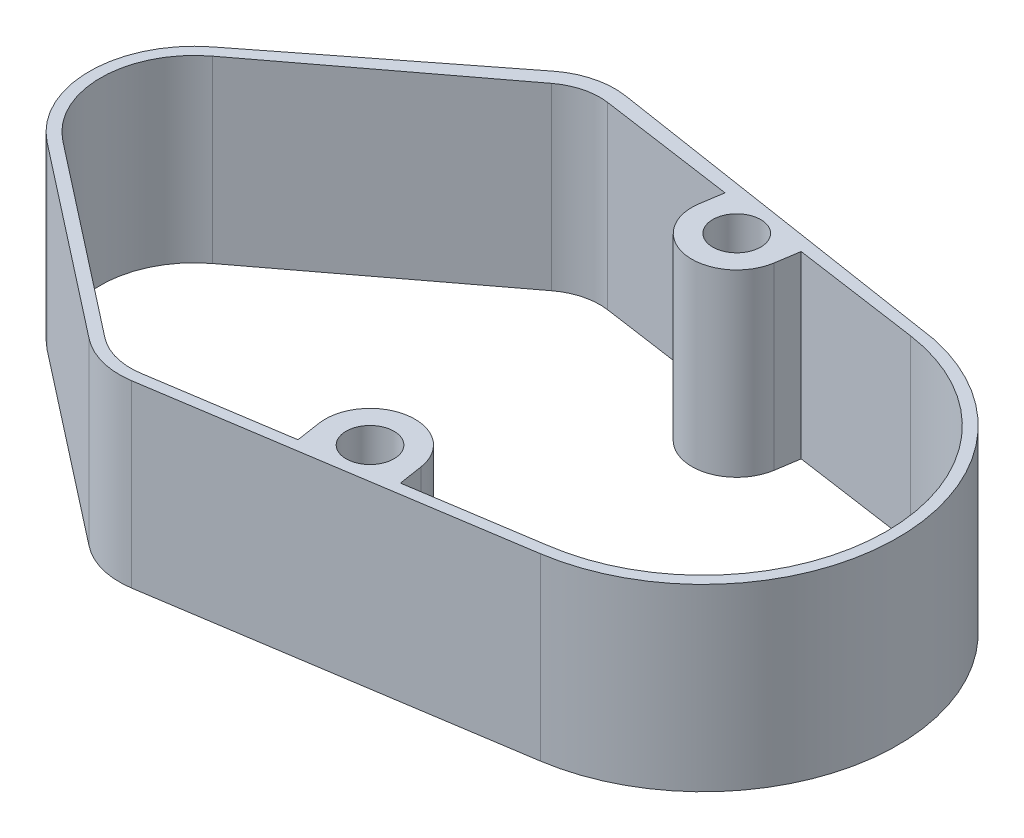
ISO-10303-21;
HEADER;
FILE_DESCRIPTION(('STEP AP214'),'2;1');
FILE_NAME('part.step','',(''),(''),'','','');
FILE_SCHEMA(('AUTOMOTIVE_DESIGN { 1 0 10303 214 1 1 1 1 }'));
ENDSEC;
DATA;
#1=APPLICATION_CONTEXT('core data for automotive mechanical design processes');
#2=APPLICATION_PROTOCOL_DEFINITION('international standard','automotive_design',2000,#1);
#3=PRODUCT_CONTEXT('',#1,'mechanical');
#4=PRODUCT('Part','Part','',(#3));
#5=PRODUCT_RELATED_PRODUCT_CATEGORY('part','',(#4));
#6=PRODUCT_DEFINITION_FORMATION('','',#4);
#7=PRODUCT_DEFINITION_CONTEXT('part definition',#1,'design');
#8=PRODUCT_DEFINITION('design','',#6,#7);
#9=PRODUCT_DEFINITION_SHAPE('','',#8);
#10=(LENGTH_UNIT() NAMED_UNIT(*) SI_UNIT(.MILLI.,.METRE.));
#11=(NAMED_UNIT(*) PLANE_ANGLE_UNIT() SI_UNIT($,.RADIAN.));
#12=(NAMED_UNIT(*) SI_UNIT($,.STERADIAN.) SOLID_ANGLE_UNIT());
#13=UNCERTAINTY_MEASURE_WITH_UNIT(LENGTH_MEASURE(1.E-05),#10,'distance_accuracy_value','');
#14=(GEOMETRIC_REPRESENTATION_CONTEXT(3) GLOBAL_UNCERTAINTY_ASSIGNED_CONTEXT((#13)) GLOBAL_UNIT_ASSIGNED_CONTEXT((#10,
#11,#12)) REPRESENTATION_CONTEXT('',''));
#15=CARTESIAN_POINT('',(0.,0.,0.));
#16=DIRECTION('',(0.,0.,1.));
#17=DIRECTION('',(1.,0.,0.));
#18=AXIS2_PLACEMENT_3D('',#15,#16,#17);
#19=CARTESIAN_POINT('',(2.76732765579161,2.,17.9645399683825));
#20=DIRECTION('',(0.152248095776488,0.,0.988342307772177));
#21=DIRECTION('',(0.988342307772177,0.,-0.152248095776488));
#22=AXIS2_PLACEMENT_3D('',#19,#20,#21);
#23=PLANE('',#22);
#24=DIRECTION('',(0.,-1.,0.));
#25=VECTOR('',#24,1.);
#26=CARTESIAN_POINT('',(35.9792252450943,2.,12.8484500010383));
#27=LINE('',#26,#25);
#28=CARTESIAN_POINT('',(35.9792252450943,14.,12.8484500010383));
#29=VERTEX_POINT('',#28);
#30=CARTESIAN_POINT('',(35.9792252450943,2.,12.8484500010383));
#31=VERTEX_POINT('',#30);
#32=EDGE_CURVE('E43',#29,#31,#27,.T.);
#33=ORIENTED_EDGE('',*,*,#32,.F.);
#34=DIRECTION('',(0.988342307772177,0.,-0.152248095776488));
#35=VECTOR('',#34,1.);
#36=CARTESIAN_POINT('',(35.9792252450943,14.,12.8484500010383));
#37=LINE('',#36,#35);
#38=CARTESIAN_POINT('',(12.3135895146823,14.,16.493996637018));
#39=VERTEX_POINT('',#38);
#40=EDGE_CURVE('E312',#39,#29,#37,.T.);
#41=ORIENTED_EDGE('',*,*,#40,.F.);
#42=DIRECTION('',(0.,-1.,0.));
#43=VECTOR('',#42,1.);
#44=CARTESIAN_POINT('',(12.3135895146823,2.,16.493996637018));
#45=LINE('',#44,#43);
#46=CARTESIAN_POINT('',(12.3135895146823,2.,16.493996637018));
#47=VERTEX_POINT('',#46);
#48=EDGE_CURVE('E385',#39,#47,#45,.T.);
#49=ORIENTED_EDGE('',*,*,#48,.T.);
#50=DIRECTION('',(-0.988342307772177,0.,0.152248095776488));
#51=VECTOR('',#50,1.);
#52=CARTESIAN_POINT('',(2.76732765579161,2.,17.9645399683825));
#53=LINE('',#52,#51);
#54=EDGE_CURVE('E324',#31,#47,#53,.T.);
#55=ORIENTED_EDGE('',*,*,#54,.F.);
#56=EDGE_LOOP('',(#33,#41,#49,#55));
#57=FACE_BOUND('',#56,.T.);
#58=ADVANCED_FACE('F40',(#57),#23,.T.);
#59=CARTESIAN_POINT('',(34.,2.,0.));
#60=DIRECTION('',(0.,-1.,0.));
#61=DIRECTION('',(0.,0.,-1.));
#62=AXIS2_PLACEMENT_3D('',#59,#60,#61);
#63=CYLINDRICAL_SURFACE('',#62,13.);
#64=ORIENTED_EDGE('',*,*,#32,.T.);
#65=CARTESIAN_POINT('',(34.,2.,0.));
#66=DIRECTION('',(0.,1.,0.));
#67=DIRECTION('',(0.,0.,1.));
#68=AXIS2_PLACEMENT_3D('',#65,#66,#67);
#69=CIRCLE('',#68,13.);
#70=CARTESIAN_POINT('',(36.8136480405111,2.,-12.6918629327663));
#71=VERTEX_POINT('',#70);
#72=EDGE_CURVE('E321',#31,#71,#69,.T.);
#73=ORIENTED_EDGE('',*,*,#72,.T.);
#74=DIRECTION('',(0.,-1.,0.));
#75=VECTOR('',#74,1.);
#76=CARTESIAN_POINT('',(36.8136480405111,2.,-12.6918629327663));
#77=LINE('',#76,#75);
#78=CARTESIAN_POINT('',(36.8136480405111,14.,-12.6918629327663));
#79=VERTEX_POINT('',#78);
#80=EDGE_CURVE('E400',#79,#71,#77,.T.);
#81=ORIENTED_EDGE('',*,*,#80,.F.);
#82=CARTESIAN_POINT('',(34.,14.,0.));
#83=DIRECTION('',(0.,1.,0.));
#84=DIRECTION('',(0.,0.,-1.));
#85=AXIS2_PLACEMENT_3D('',#82,#83,#84);
#86=CIRCLE('',#85,13.);
#87=EDGE_CURVE('E314',#29,#79,#86,.T.);
#88=ORIENTED_EDGE('',*,*,#87,.F.);
#89=EDGE_LOOP('',(#64,#73,#81,#88));
#90=FACE_BOUND('',#89,.T.);
#91=ADVANCED_FACE('F408',(#90),#63,.T.);
#92=CARTESIAN_POINT('',(2.78895107485444,2.,-17.9719394377376));
#93=DIRECTION('',(-0.153348167519012,0.,0.988172221588201));
#94=DIRECTION('',(0.988172221588201,0.,0.153348167519012));
#95=AXIS2_PLACEMENT_3D('',#92,#93,#94);
#96=PLANE('',#95);
#97=DIRECTION('',(-0.988172221588201,0.,-0.153348167519012));
#98=VECTOR('',#97,1.);
#99=CARTESIAN_POINT('',(2.78895107485444,2.,-17.9719394377376));
#100=LINE('',#99,#98);
#101=CARTESIAN_POINT('',(12.3190673039404,2.,-16.4930212612838));
#102=VERTEX_POINT('',#101);
#103=EDGE_CURVE('E319',#71,#102,#100,.T.);
#104=ORIENTED_EDGE('',*,*,#103,.T.);
#105=DIRECTION('',(0.,-1.,0.));
#106=VECTOR('',#105,1.);
#107=CARTESIAN_POINT('',(12.3190673039404,2.,-16.4930212612838));
#108=LINE('',#107,#106);
#109=CARTESIAN_POINT('',(12.3190673039404,14.,-16.4930212612838));
#110=VERTEX_POINT('',#109);
#111=EDGE_CURVE('E398',#110,#102,#108,.T.);
#112=ORIENTED_EDGE('',*,*,#111,.F.);
#113=DIRECTION('',(-0.988172221588201,0.,-0.153348167519012));
#114=VECTOR('',#113,1.);
#115=CARTESIAN_POINT('',(12.3190673039404,14.,-16.4930212612838));
#116=LINE('',#115,#114);
#117=EDGE_CURVE('E317',#79,#110,#116,.T.);
#118=ORIENTED_EDGE('',*,*,#117,.F.);
#119=ORIENTED_EDGE('',*,*,#80,.T.);
#120=EDGE_LOOP('',(#104,#112,#118,#119));
#121=FACE_BOUND('',#120,.T.);
#122=ADVANCED_FACE('F434',(#121),#96,.F.);
#123=CARTESIAN_POINT('',(11.5523264663453,2.,-11.5521601533428));
#124=DIRECTION('',(0.,-1.,0.));
#125=DIRECTION('',(0.,0.,-1.));
#126=AXIS2_PLACEMENT_3D('',#123,#124,#125);
#127=CYLINDRICAL_SURFACE('',#126,5.);
#128=ORIENTED_EDGE('',*,*,#111,.T.);
#129=CARTESIAN_POINT('',(11.5523264663453,2.,-11.5521601533428));
#130=DIRECTION('',(0.,1.,0.));
#131=DIRECTION('',(0.,0.,1.));
#132=AXIS2_PLACEMENT_3D('',#129,#130,#131);
#133=CIRCLE('',#132,5.);
#134=CARTESIAN_POINT('',(8.47622977455886,2.,-15.4939400993545));
#135=VERTEX_POINT('',#134);
#136=EDGE_CURVE('E11',#102,#135,#133,.T.);
#137=ORIENTED_EDGE('',*,*,#136,.T.);
#138=DIRECTION('',(0.,-1.,0.));
#139=VECTOR('',#138,1.);
#140=CARTESIAN_POINT('',(8.47622977455886,12.,-15.4939400993545));
#141=LINE('',#140,#139);
#142=CARTESIAN_POINT('',(8.47622977455886,14.,-15.4939400993545));
#143=VERTEX_POINT('',#142);
#144=EDGE_CURVE('E359',#143,#135,#141,.T.);
#145=ORIENTED_EDGE('',*,*,#144,.F.);
#146=CARTESIAN_POINT('',(11.5523264663454,14.,-11.5521601533428));
#147=DIRECTION('',(0.,1.,0.));
#148=DIRECTION('',(0.,0.,-1.));
#149=AXIS2_PLACEMENT_3D('',#146,#147,#148);
#150=CIRCLE('',#149,5.00000000000003);
#151=EDGE_CURVE('E297',#110,#143,#150,.T.);
#152=ORIENTED_EDGE('',*,*,#151,.F.);
#153=EDGE_LOOP('',(#128,#137,#145,#152));
#154=FACE_BOUND('',#153,.T.);
#155=ADVANCED_FACE('F430',(#154),#127,.T.);
#156=CARTESIAN_POINT('',(11.5523490357999,2.,11.5522850981571));
#157=DIRECTION('',(0.,-1.,0.));
#158=DIRECTION('',(0.,0.,-1.));
#159=AXIS2_PLACEMENT_3D('',#156,#157,#158);
#160=CYLINDRICAL_SURFACE('',#159,5.00000000000001);
#161=CARTESIAN_POINT('',(11.5523490357999,2.,11.5522850981571));
#162=DIRECTION('',(0.,1.,0.));
#163=DIRECTION('',(0.,0.,1.));
#164=AXIS2_PLACEMENT_3D('',#161,#162,#163);
#165=CIRCLE('',#164,5.00000000000001);
#166=CARTESIAN_POINT('',(8.45337216873125,2.,15.4761024202777));
#167=VERTEX_POINT('',#166);
#168=EDGE_CURVE('E334',#167,#47,#165,.T.);
#169=ORIENTED_EDGE('',*,*,#168,.T.);
#170=ORIENTED_EDGE('',*,*,#48,.F.);
#171=CARTESIAN_POINT('',(11.5523490357999,14.,11.5522850981569));
#172=DIRECTION('',(0.,1.,0.));
#173=DIRECTION('',(0.,0.,1.));
#174=AXIS2_PLACEMENT_3D('',#171,#172,#173);
#175=CIRCLE('',#174,5.00000000000016);
#176=CARTESIAN_POINT('',(8.45337216873125,14.,15.4761024202777));
#177=VERTEX_POINT('',#176);
#178=EDGE_CURVE('E309',#177,#39,#175,.T.);
#179=ORIENTED_EDGE('',*,*,#178,.F.);
#180=DIRECTION('',(0.,-1.,0.));
#181=VECTOR('',#180,1.);
#182=CARTESIAN_POINT('',(8.45337216873125,12.,15.4761024202777));
#183=LINE('',#182,#181);
#184=EDGE_CURVE('E388',#177,#167,#183,.T.);
#185=ORIENTED_EDGE('',*,*,#184,.T.);
#186=EDGE_LOOP('',(#169,#170,#179,#185));
#187=FACE_BOUND('',#186,.T.);
#188=ADVANCED_FACE('F415',(#187),#160,.T.);
#189=CARTESIAN_POINT('',(2.65295718564578,12.,17.2225081490792));
#190=DIRECTION('',(-0.152244452065252,0.,-0.988342869056762));
#191=DIRECTION('',(-0.988342869056762,0.,0.152244452065252));
#192=AXIS2_PLACEMENT_3D('',#189,#190,#191);
#193=PLANE('',#192);
#194=DIRECTION('',(0.,1.,0.));
#195=VECTOR('',#194,1.);
#196=CARTESIAN_POINT('',(21.2883996349892,12.,14.3519023972499));
#197=LINE('',#196,#195);
#198=CARTESIAN_POINT('',(21.2883996349892,2.,14.3519023972499));
#199=VERTEX_POINT('',#198);
#200=CARTESIAN_POINT('',(21.2883996349892,14.,14.3519023972499));
#201=VERTEX_POINT('',#200);
#202=EDGE_CURVE('E63',#199,#201,#197,.T.);
#203=ORIENTED_EDGE('',*,*,#202,.F.);
#204=DIRECTION('',(0.988342869056762,0.,-0.152244452065252));
#205=VECTOR('',#204,1.);
#206=CARTESIAN_POINT('',(2.65295718564578,2.,17.2225081490792));
#207=LINE('',#206,#205);
#208=CARTESIAN_POINT('',(12.2786286195108,2.,15.7397685866361));
#209=VERTEX_POINT('',#208);
#210=EDGE_CURVE('E336',#209,#199,#207,.T.);
#211=ORIENTED_EDGE('',*,*,#210,.F.);
#212=DIRECTION('',(0.,-1.,0.));
#213=VECTOR('',#212,1.);
#214=CARTESIAN_POINT('',(12.2786286195108,12.,15.7397685866361));
#215=LINE('',#214,#213);
#216=CARTESIAN_POINT('',(12.2786286195108,14.,15.7397685866361));
#217=VERTEX_POINT('',#216);
#218=EDGE_CURVE('E382',#217,#209,#215,.T.);
#219=ORIENTED_EDGE('',*,*,#218,.F.);
#220=DIRECTION('',(0.988342869056762,0.,-0.152244452065252));
#221=VECTOR('',#220,1.);
#222=CARTESIAN_POINT('',(12.2786286195108,14.,15.7397685866361));
#223=LINE('',#222,#221);
#224=EDGE_CURVE('E288',#217,#201,#223,.T.);
#225=ORIENTED_EDGE('',*,*,#224,.T.);
#226=EDGE_LOOP('',(#203,#211,#219,#225));
#227=FACE_BOUND('',#226,.T.);
#228=ADVANCED_FACE('F468',(#227),#193,.T.);
#229=CARTESIAN_POINT('',(11.5523490357999,12.,11.5522850981571));
#230=DIRECTION('',(0.,-1.,0.));
#231=DIRECTION('',(0.,0.,-1.));
#232=AXIS2_PLACEMENT_3D('',#229,#230,#231);
#233=CYLINDRICAL_SURFACE('',#232,4.25);
#234=CARTESIAN_POINT('',(11.5523490357999,2.,11.5522850981571));
#235=DIRECTION('',(0.,1.,0.));
#236=DIRECTION('',(0.,0.,1.));
#237=AXIS2_PLACEMENT_3D('',#234,#235,#236);
#238=CIRCLE('',#237,4.25);
#239=CARTESIAN_POINT('',(8.93764936313277,2.,14.9027844074772));
#240=VERTEX_POINT('',#239);
#241=EDGE_CURVE('E339',#240,#209,#238,.T.);
#242=ORIENTED_EDGE('',*,*,#241,.F.);
#243=DIRECTION('',(0.,-1.,0.));
#244=VECTOR('',#243,1.);
#245=CARTESIAN_POINT('',(8.93764936313277,12.,14.9027844074772));
#246=LINE('',#245,#244);
#247=CARTESIAN_POINT('',(8.93764936313277,14.,14.9027844074772));
#248=VERTEX_POINT('',#247);
#249=EDGE_CURVE('E379',#248,#240,#246,.T.);
#250=ORIENTED_EDGE('',*,*,#249,.F.);
#251=CARTESIAN_POINT('',(11.5523490357999,14.,11.5522850981571));
#252=DIRECTION('',(0.,1.,0.));
#253=DIRECTION('',(0.,0.,-1.));
#254=AXIS2_PLACEMENT_3D('',#251,#252,#253);
#255=CIRCLE('',#254,4.25000000000003);
#256=EDGE_CURVE('E285',#248,#217,#255,.T.);
#257=ORIENTED_EDGE('',*,*,#256,.T.);
#258=ORIENTED_EDGE('',*,*,#218,.T.);
#259=EDGE_LOOP('',(#242,#250,#257,#258));
#260=FACE_BOUND('',#259,.T.);
#261=ADVANCED_FACE('F476',(#260),#233,.F.);
#262=CARTESIAN_POINT('',(-3.84514657745198,12.,4.92720486664771));
#263=DIRECTION('',(-0.615223452392257,0.,0.788352778663558));
#264=DIRECTION('',(0.788352778663558,0.,0.615223452392257));
#265=AXIS2_PLACEMENT_3D('',#262,#263,#264);
#266=PLANE('',#265);
#267=DIRECTION('',(-0.788352778663558,0.,-0.615223452392257));
#268=VECTOR('',#267,1.);
#269=CARTESIAN_POINT('',(-3.84514657745198,2.,4.92720486664771));
#270=LINE('',#269,#268);
#271=CARTESIAN_POINT('',(-3.84514657745198,2.,4.92720486664771));
#272=VERTEX_POINT('',#271);
#273=EDGE_CURVE('E341',#240,#272,#270,.T.);
#274=ORIENTED_EDGE('',*,*,#273,.T.);
#275=DIRECTION('',(0.,-1.,0.));
#276=VECTOR('',#275,1.);
#277=CARTESIAN_POINT('',(-3.84514657745198,12.,4.92720486664771));
#278=LINE('',#277,#276);
#279=CARTESIAN_POINT('',(-3.84514657745198,14.,4.92720486664771));
#280=VERTEX_POINT('',#279);
#281=EDGE_CURVE('E376',#280,#272,#278,.T.);
#282=ORIENTED_EDGE('',*,*,#281,.F.);
#283=DIRECTION('',(0.788352778663558,0.,0.615223452392257));
#284=VECTOR('',#283,1.);
#285=CARTESIAN_POINT('',(-3.84514657745198,14.,4.92720486664771));
#286=LINE('',#285,#284);
#287=EDGE_CURVE('E282',#280,#248,#286,.T.);
#288=ORIENTED_EDGE('',*,*,#287,.T.);
#289=ORIENTED_EDGE('',*,*,#249,.T.);
#290=EDGE_LOOP('',(#274,#282,#288,#289));
#291=FACE_BOUND('',#290,.T.);
#292=ADVANCED_FACE('F481',(#291),#266,.F.);
#293=CARTESIAN_POINT('',(0.,12.,0.));
#294=DIRECTION('',(0.,-1.,0.));
#295=DIRECTION('',(0.,0.,-1.));
#296=AXIS2_PLACEMENT_3D('',#293,#294,#295);
#297=CYLINDRICAL_SURFACE('',#296,6.2500000000006);
#298=CARTESIAN_POINT('',(0.,2.,0.));
#299=DIRECTION('',(0.,1.,0.));
#300=DIRECTION('',(0.,0.,1.));
#301=AXIS2_PLACEMENT_3D('',#298,#299,#300);
#302=CIRCLE('',#301,6.2500000000006);
#303=CARTESIAN_POINT('',(-3.76862092271279,2.,-4.98597997798817));
#304=VERTEX_POINT('',#303);
#305=EDGE_CURVE('E344',#304,#272,#302,.T.);
#306=ORIENTED_EDGE('',*,*,#305,.F.);
#307=DIRECTION('',(0.,-1.,0.));
#308=VECTOR('',#307,1.);
#309=CARTESIAN_POINT('',(-3.76862092271279,12.,-4.98597997798817));
#310=LINE('',#309,#308);
#311=CARTESIAN_POINT('',(-3.76862092271279,14.,-4.98597997798817));
#312=VERTEX_POINT('',#311);
#313=EDGE_CURVE('E373',#312,#304,#310,.T.);
#314=ORIENTED_EDGE('',*,*,#313,.F.);
#315=CARTESIAN_POINT('',(0.,14.,0.));
#316=DIRECTION('',(0.,1.,0.));
#317=DIRECTION('',(0.,0.,1.));
#318=AXIS2_PLACEMENT_3D('',#315,#316,#317);
#319=CIRCLE('',#318,6.25000000000062);
#320=EDGE_CURVE('E279',#312,#280,#319,.T.);
#321=ORIENTED_EDGE('',*,*,#320,.T.);
#322=ORIENTED_EDGE('',*,*,#281,.T.);
#323=EDGE_LOOP('',(#306,#314,#321,#322));
#324=FACE_BOUND('',#323,.T.);
#325=ADVANCED_FACE('F492',(#324),#297,.F.);
#326=CARTESIAN_POINT('',(-3.76862092271279,12.,-4.98597997798817));
#327=DIRECTION('',(0.602979347633988,0.,0.797756796478031));
#328=DIRECTION('',(0.797756796478031,0.,-0.602979347633988));
#329=AXIS2_PLACEMENT_3D('',#326,#327,#328);
#330=PLANE('',#329);
#331=DIRECTION('',(-0.797756796478031,0.,0.602979347633988));
#332=VECTOR('',#331,1.);
#333=CARTESIAN_POINT('',(-3.76862092271279,2.,-4.98597997798817));
#334=LINE('',#333,#332);
#335=CARTESIAN_POINT('',(9.14040907580912,2.,-14.7431873392553));
#336=VERTEX_POINT('',#335);
#337=EDGE_CURVE('E346',#336,#304,#334,.T.);
#338=ORIENTED_EDGE('',*,*,#337,.F.);
#339=DIRECTION('',(0.,-1.,0.));
#340=VECTOR('',#339,1.);
#341=CARTESIAN_POINT('',(9.14040907580912,12.,-14.7431873392553));
#342=LINE('',#341,#340);
#343=CARTESIAN_POINT('',(9.14040907580912,14.,-14.7431873392553));
#344=VERTEX_POINT('',#343);
#345=EDGE_CURVE('E370',#344,#336,#342,.T.);
#346=ORIENTED_EDGE('',*,*,#345,.F.);
#347=DIRECTION('',(-0.797756796478031,0.,0.602979347633988));
#348=VECTOR('',#347,1.);
#349=CARTESIAN_POINT('',(9.14040907580912,14.,-14.7431873392553));
#350=LINE('',#349,#348);
#351=EDGE_CURVE('E276',#344,#312,#350,.T.);
#352=ORIENTED_EDGE('',*,*,#351,.T.);
#353=ORIENTED_EDGE('',*,*,#313,.T.);
#354=EDGE_LOOP('',(#338,#346,#352,#353));
#355=FACE_BOUND('',#354,.T.);
#356=ADVANCED_FACE('F503',(#355),#330,.T.);
#357=CARTESIAN_POINT('',(11.5523264663453,12.,-11.5521601533428));
#358=DIRECTION('',(0.,-1.,0.));
#359=DIRECTION('',(0.,0.,-1.));
#360=AXIS2_PLACEMENT_3D('',#357,#358,#359);
#361=CYLINDRICAL_SURFACE('',#360,4.00000000000045);
#362=CARTESIAN_POINT('',(11.5523264663453,2.,-11.5521601533428));
#363=DIRECTION('',(0.,1.,0.));
#364=DIRECTION('',(0.,0.,1.));
#365=AXIS2_PLACEMENT_3D('',#362,#363,#364);
#366=CIRCLE('',#365,4.00000000000045);
#367=CARTESIAN_POINT('',(12.1199163344507,2.,-15.5116855973358));
#368=VERTEX_POINT('',#367);
#369=EDGE_CURVE('E348',#368,#336,#366,.T.);
#370=ORIENTED_EDGE('',*,*,#369,.F.);
#371=DIRECTION('',(0.,-1.,0.));
#372=VECTOR('',#371,1.);
#373=CARTESIAN_POINT('',(12.1199163344507,12.,-15.5116855973358));
#374=LINE('',#373,#372);
#375=CARTESIAN_POINT('',(12.1199163344507,14.,-15.5116855973358));
#376=VERTEX_POINT('',#375);
#377=EDGE_CURVE('E367',#376,#368,#374,.T.);
#378=ORIENTED_EDGE('',*,*,#377,.F.);
#379=CARTESIAN_POINT('',(11.5523264663454,14.,-11.5521601533428));
#380=DIRECTION('',(0.,1.,0.));
#381=DIRECTION('',(0.,0.,-1.));
#382=AXIS2_PLACEMENT_3D('',#379,#380,#381);
#383=CIRCLE('',#382,4.00000000000048);
#384=EDGE_CURVE('E273',#376,#344,#383,.T.);
#385=ORIENTED_EDGE('',*,*,#384,.T.);
#386=ORIENTED_EDGE('',*,*,#345,.T.);
#387=EDGE_LOOP('',(#370,#378,#385,#386));
#388=FACE_BOUND('',#387,.T.);
#389=ADVANCED_FACE('F514',(#388),#361,.F.);
#390=CARTESIAN_POINT('',(2.42283027012117,12.,-16.9017430368225));
#391=DIRECTION('',(0.141897467026329,0.,-0.989881360998131));
#392=DIRECTION('',(-0.989881360998131,0.,-0.141897467026329));
#393=AXIS2_PLACEMENT_3D('',#390,#391,#392);
#394=PLANE('',#393);
#395=DIRECTION('',(0.989881360998131,0.,0.141897467026329));
#396=VECTOR('',#395,1.);
#397=CARTESIAN_POINT('',(2.42283027012117,2.,-16.9017430368225));
#398=LINE('',#397,#396);
#399=CARTESIAN_POINT('',(21.2667779179853,2.,-14.2005017109807));
#400=VERTEX_POINT('',#399);
#401=EDGE_CURVE('E350',#368,#400,#398,.T.);
#402=ORIENTED_EDGE('',*,*,#401,.T.);
#403=DIRECTION('',(0.,1.,0.));
#404=VECTOR('',#403,1.);
#405=CARTESIAN_POINT('',(21.2667779179853,12.,-14.2005017109807));
#406=LINE('',#405,#404);
#407=CARTESIAN_POINT('',(21.2667779179853,14.,-14.2005017109807));
#408=VERTEX_POINT('',#407);
#409=EDGE_CURVE('E269',#400,#408,#406,.T.);
#410=ORIENTED_EDGE('',*,*,#409,.T.);
#411=DIRECTION('',(-0.989881360998131,0.,-0.141897467026329));
#412=VECTOR('',#411,1.);
#413=CARTESIAN_POINT('',(22.1338286093925,14.,-14.0762117690324));
#414=LINE('',#413,#412);
#415=EDGE_CURVE('E271',#408,#376,#414,.T.);
#416=ORIENTED_EDGE('',*,*,#415,.T.);
#417=ORIENTED_EDGE('',*,*,#377,.T.);
#418=EDGE_LOOP('',(#402,#410,#416,#417));
#419=FACE_BOUND('',#418,.T.);
#420=ADVANCED_FACE('F525',(#419),#394,.F.);
#421=CARTESIAN_POINT('',(2.42283027012117,12.,-16.9017430368225));
#422=DIRECTION('',(0.141897467026329,0.,-0.989881360998131));
#423=DIRECTION('',(-0.989881360998131,0.,-0.141897467026329));
#424=AXIS2_PLACEMENT_3D('',#421,#422,#423);
#425=PLANE('',#424);
#426=DIRECTION('',(-0.989881360998131,0.,-0.141897467026329));
#427=VECTOR('',#426,1.);
#428=CARTESIAN_POINT('',(35.7382439710726,14.,-12.1260466722273));
#429=LINE('',#428,#427);
#430=CARTESIAN_POINT('',(35.7382439710726,14.,-12.1260466722273));
#431=VERTEX_POINT('',#430);
#432=CARTESIAN_POINT('',(27.206464160853,14.,-13.3490598453169));
#433=VERTEX_POINT('',#432);
#434=EDGE_CURVE('E295',#431,#433,#429,.T.);
#435=ORIENTED_EDGE('',*,*,#434,.T.);
#436=DIRECTION('',(0.,-1.,0.));
#437=VECTOR('',#436,1.);
#438=CARTESIAN_POINT('',(27.206464160853,12.,-13.3490598453169));
#439=LINE('',#438,#437);
#440=CARTESIAN_POINT('',(27.206464160853,2.,-13.3490598453169));
#441=VERTEX_POINT('',#440);
#442=EDGE_CURVE('E266',#433,#441,#439,.T.);
#443=ORIENTED_EDGE('',*,*,#442,.T.);
#444=DIRECTION('',(0.989881360998131,0.,0.141897467026329));
#445=VECTOR('',#444,1.);
#446=CARTESIAN_POINT('',(2.42283027012117,2.,-16.9017430368225));
#447=LINE('',#446,#445);
#448=CARTESIAN_POINT('',(35.7382439710726,2.,-12.1260466722273));
#449=VERTEX_POINT('',#448);
#450=EDGE_CURVE('E352',#441,#449,#447,.T.);
#451=ORIENTED_EDGE('',*,*,#450,.T.);
#452=DIRECTION('',(0.,-1.,0.));
#453=VECTOR('',#452,1.);
#454=CARTESIAN_POINT('',(35.7382439710726,12.,-12.1260466722273));
#455=LINE('',#454,#453);
#456=EDGE_CURVE('E363',#431,#449,#455,.T.);
#457=ORIENTED_EDGE('',*,*,#456,.F.);
#458=EDGE_LOOP('',(#435,#443,#451,#457));
#459=FACE_BOUND('',#458,.T.);
#460=ADVANCED_FACE('F539',(#459),#425,.F.);
#461=CARTESIAN_POINT('',(34.,12.,0.));
#462=DIRECTION('',(0.,-1.,0.));
#463=DIRECTION('',(0.,0.,-1.));
#464=AXIS2_PLACEMENT_3D('',#461,#462,#463);
#465=CYLINDRICAL_SURFACE('',#464,12.2500000000002);
#466=CARTESIAN_POINT('',(34.,2.,0.));
#467=DIRECTION('',(0.,1.,0.));
#468=DIRECTION('',(0.,0.,1.));
#469=AXIS2_PLACEMENT_3D('',#466,#467,#468);
#470=CIRCLE('',#469,12.2500000000002);
#471=CARTESIAN_POINT('',(35.7382439710724,2.,12.1260466722273));
#472=VERTEX_POINT('',#471);
#473=EDGE_CURVE('E354',#472,#449,#470,.T.);
#474=ORIENTED_EDGE('',*,*,#473,.F.);
#475=DIRECTION('',(0.,-1.,0.));
#476=VECTOR('',#475,1.);
#477=CARTESIAN_POINT('',(35.7382439710724,12.,12.1260466722273));
#478=LINE('',#477,#476);
#479=CARTESIAN_POINT('',(35.7382439710724,14.,12.1260466722273));
#480=VERTEX_POINT('',#479);
#481=EDGE_CURVE('E360',#480,#472,#478,.T.);
#482=ORIENTED_EDGE('',*,*,#481,.F.);
#483=CARTESIAN_POINT('',(34.,14.,0.));
#484=DIRECTION('',(0.,1.,0.));
#485=DIRECTION('',(0.,0.,1.));
#486=AXIS2_PLACEMENT_3D('',#483,#484,#485);
#487=CIRCLE('',#486,12.2500000000002);
#488=EDGE_CURVE('E292',#480,#431,#487,.T.);
#489=ORIENTED_EDGE('',*,*,#488,.T.);
#490=ORIENTED_EDGE('',*,*,#456,.T.);
#491=EDGE_LOOP('',(#474,#482,#489,#490));
#492=FACE_BOUND('',#491,.T.);
#493=ADVANCED_FACE('F534',(#492),#465,.F.);
#494=CARTESIAN_POINT('',(-4.30653536850108,12.,-5.51849192441642));
#495=DIRECTION('',(-0.615219338357298,0.,-0.788355989202346));
#496=DIRECTION('',(-0.788355989202346,0.,0.615219338357298));
#497=AXIS2_PLACEMENT_3D('',#494,#495,#496);
#498=PLANE('',#497);
#499=DIRECTION('',(0.788355989202346,0.,-0.615219338357298));
#500=VECTOR('',#499,1.);
#501=CARTESIAN_POINT('',(-4.30653536850108,2.,-5.51849192441642));
#502=LINE('',#501,#500);
#503=CARTESIAN_POINT('',(-4.30653536850108,2.,-5.51849192441642));
#504=VERTEX_POINT('',#503);
#505=EDGE_CURVE('E326',#504,#135,#502,.T.);
#506=ORIENTED_EDGE('',*,*,#505,.F.);
#507=DIRECTION('',(0.,-1.,0.));
#508=VECTOR('',#507,1.);
#509=CARTESIAN_POINT('',(-4.30653536850108,12.,-5.51849192441642));
#510=LINE('',#509,#508);
#511=CARTESIAN_POINT('',(-4.30653536850108,14.,-5.51849192441642));
#512=VERTEX_POINT('',#511);
#513=EDGE_CURVE('E364',#512,#504,#510,.T.);
#514=ORIENTED_EDGE('',*,*,#513,.F.);
#515=DIRECTION('',(-0.788355989202346,0.,0.615219338357298));
#516=VECTOR('',#515,1.);
#517=CARTESIAN_POINT('',(-4.30653536850108,14.,-5.51849192441642));
#518=LINE('',#517,#516);
#519=EDGE_CURVE('E300',#143,#512,#518,.T.);
#520=ORIENTED_EDGE('',*,*,#519,.F.);
#521=ORIENTED_EDGE('',*,*,#144,.T.);
#522=EDGE_LOOP('',(#506,#514,#520,#521));
#523=FACE_BOUND('',#522,.T.);
#524=ADVANCED_FACE('F433',(#523),#498,.T.);
#525=CARTESIAN_POINT('',(0.,12.,0.));
#526=DIRECTION('',(0.,-1.,0.));
#527=DIRECTION('',(0.,0.,-1.));
#528=AXIS2_PLACEMENT_3D('',#525,#526,#527);
#529=CYLINDRICAL_SURFACE('',#528,7.);
#530=CARTESIAN_POINT('',(0.,2.,0.));
#531=DIRECTION('',(0.,1.,0.));
#532=DIRECTION('',(0.,0.,1.));
#533=AXIS2_PLACEMENT_3D('',#530,#531,#532);
#534=CIRCLE('',#533,7.);
#535=CARTESIAN_POINT('',(-4.30653536850108,2.,5.51849192441642));
#536=VERTEX_POINT('',#535);
#537=EDGE_CURVE('E328',#504,#536,#534,.T.);
#538=ORIENTED_EDGE('',*,*,#537,.T.);
#539=DIRECTION('',(0.,-1.,0.));
#540=VECTOR('',#539,1.);
#541=CARTESIAN_POINT('',(-4.30653536850108,12.,5.51849192441642));
#542=LINE('',#541,#540);
#543=CARTESIAN_POINT('',(-4.30653536850109,14.,5.51849192441642));
#544=VERTEX_POINT('',#543);
#545=EDGE_CURVE('E391',#544,#536,#542,.T.);
#546=ORIENTED_EDGE('',*,*,#545,.F.);
#547=CARTESIAN_POINT('',(0.,14.,0.));
#548=DIRECTION('',(0.,1.,0.));
#549=DIRECTION('',(0.,0.,1.));
#550=AXIS2_PLACEMENT_3D('',#547,#548,#549);
#551=CIRCLE('',#550,7.00000000000001);
#552=EDGE_CURVE('E303',#512,#544,#551,.T.);
#553=ORIENTED_EDGE('',*,*,#552,.F.);
#554=ORIENTED_EDGE('',*,*,#513,.T.);
#555=EDGE_LOOP('',(#538,#546,#553,#554));
#556=FACE_BOUND('',#555,.T.);
#557=ADVANCED_FACE('F425',(#556),#529,.T.);
#558=CARTESIAN_POINT('',(-4.30653536850108,12.,5.51849192441642));
#559=DIRECTION('',(0.615219338357298,0.,-0.788355989202346));
#560=DIRECTION('',(-0.788355989202346,0.,-0.615219338357298));
#561=AXIS2_PLACEMENT_3D('',#558,#559,#560);
#562=PLANE('',#561);
#563=DIRECTION('',(0.788355989202346,0.,0.615219338357298));
#564=VECTOR('',#563,1.);
#565=CARTESIAN_POINT('',(-4.30653536850108,2.,5.51849192441642));
#566=LINE('',#565,#564);
#567=EDGE_CURVE('E331',#536,#167,#566,.T.);
#568=ORIENTED_EDGE('',*,*,#567,.T.);
#569=ORIENTED_EDGE('',*,*,#184,.F.);
#570=DIRECTION('',(0.788355989202346,0.,0.615219338357298));
#571=VECTOR('',#570,1.);
#572=CARTESIAN_POINT('',(8.45337216873125,14.,15.4761024202777));
#573=LINE('',#572,#571);
#574=EDGE_CURVE('E306',#544,#177,#573,.T.);
#575=ORIENTED_EDGE('',*,*,#574,.F.);
#576=ORIENTED_EDGE('',*,*,#545,.T.);
#577=EDGE_LOOP('',(#568,#569,#575,#576));
#578=FACE_BOUND('',#577,.T.);
#579=ADVANCED_FACE('F419',(#578),#562,.F.);
#580=CARTESIAN_POINT('',(2.65295718564577,12.,17.2225081490792));
#581=DIRECTION('',(-0.152244452065252,0.,-0.988342869056762));
#582=DIRECTION('',(-0.988342869056762,0.,0.152244452065252));
#583=AXIS2_PLACEMENT_3D('',#580,#581,#582);
#584=PLANE('',#583);
#585=DIRECTION('',(0.,-1.,0.));
#586=VECTOR('',#585,1.);
#587=CARTESIAN_POINT('',(27.21845684937,12.,13.4384356848522));
#588=LINE('',#587,#586);
#589=CARTESIAN_POINT('',(27.2184568493701,14.,13.4384356848522));
#590=VERTEX_POINT('',#589);
#591=CARTESIAN_POINT('',(27.21845684937,2.,13.4384356848522));
#592=VERTEX_POINT('',#591);
#593=EDGE_CURVE('E236',#590,#592,#588,.T.);
#594=ORIENTED_EDGE('',*,*,#593,.F.);
#595=DIRECTION('',(0.988342869056762,0.,-0.152244452065252));
#596=VECTOR('',#595,1.);
#597=CARTESIAN_POINT('',(26.1172556261498,14.,13.6080648510976));
#598=LINE('',#597,#596);
#599=EDGE_CURVE('E290',#590,#480,#598,.T.);
#600=ORIENTED_EDGE('',*,*,#599,.T.);
#601=ORIENTED_EDGE('',*,*,#481,.T.);
#602=DIRECTION('',(0.988342869056762,0.,-0.152244452065252));
#603=VECTOR('',#602,1.);
#604=CARTESIAN_POINT('',(2.65295718564577,2.,17.2225081490792));
#605=LINE('',#604,#603);
#606=EDGE_CURVE('E357',#592,#472,#605,.T.);
#607=ORIENTED_EDGE('',*,*,#606,.F.);
#608=EDGE_LOOP('',(#594,#600,#601,#607));
#609=FACE_BOUND('',#608,.T.);
#610=ADVANCED_FACE('F568',(#609),#584,.T.);
#611=CARTESIAN_POINT('',(0.,2.,0.));
#612=DIRECTION('',(0.,1.,0.));
#613=DIRECTION('',(0.,0.,1.));
#614=AXIS2_PLACEMENT_3D('',#611,#612,#613);
#615=PLANE('',#614);
#616=CARTESIAN_POINT('',(24.,2.,12.25));
#617=DIRECTION('',(0.,1.,0.));
#618=DIRECTION('',(0.,0.,1.));
#619=AXIS2_PLACEMENT_3D('',#616,#617,#618);
#620=CIRCLE('',#619,1.6);
#621=CARTESIAN_POINT('',(24.,2.,13.85));
#622=VERTEX_POINT('',#621);
#623=EDGE_CURVE('E233',#622,#622,#620,.F.);
#624=ORIENTED_EDGE('',*,*,#623,.F.);
#625=EDGE_LOOP('',(#624));
#626=FACE_BOUND('',#625,.T.);
#627=ORIENTED_EDGE('',*,*,#54,.T.);
#628=ORIENTED_EDGE('',*,*,#168,.F.);
#629=ORIENTED_EDGE('',*,*,#567,.F.);
#630=ORIENTED_EDGE('',*,*,#537,.F.);
#631=ORIENTED_EDGE('',*,*,#505,.T.);
#632=ORIENTED_EDGE('',*,*,#136,.F.);
#633=ORIENTED_EDGE('',*,*,#103,.F.);
#634=ORIENTED_EDGE('',*,*,#72,.F.);
#635=EDGE_LOOP('',(#627,#628,#629,#630,#631,#632,#633,#634));
#636=FACE_BOUND('',#635,.T.);
#637=ORIENTED_EDGE('',*,*,#210,.T.);
#638=DIRECTION('',(-0.152248095776488,0.,-0.988342307772177));
#639=VECTOR('',#638,1.);
#640=CARTESIAN_POINT('',(21.0349730766835,2.,12.7067442873295));
#641=LINE('',#640,#639);
#642=CARTESIAN_POINT('',(21.0349730766835,2.,12.7067442873295));
#643=VERTEX_POINT('',#642);
#644=EDGE_CURVE('E237',#199,#643,#641,.T.);
#645=ORIENTED_EDGE('',*,*,#644,.T.);
#646=CARTESIAN_POINT('',(24.,2.,12.25));
#647=DIRECTION('',(0.,1.,0.));
#648=DIRECTION('',(0.,0.,1.));
#649=AXIS2_PLACEMENT_3D('',#646,#647,#648);
#650=CIRCLE('',#649,3.);
#651=CARTESIAN_POINT('',(26.9650269233165,2.,11.7932557126705));
#652=VERTEX_POINT('',#651);
#653=EDGE_CURVE('E209',#643,#652,#650,.F.);
#654=ORIENTED_EDGE('',*,*,#653,.T.);
#655=DIRECTION('',(0.152248095776488,0.,0.988342307772177));
#656=VECTOR('',#655,1.);
#657=CARTESIAN_POINT('',(26.9650269233165,2.,11.7932557126705));
#658=LINE('',#657,#656);
#659=EDGE_CURVE('E55',#652,#592,#658,.T.);
#660=ORIENTED_EDGE('',*,*,#659,.T.);
#661=ORIENTED_EDGE('',*,*,#606,.T.);
#662=ORIENTED_EDGE('',*,*,#473,.T.);
#663=ORIENTED_EDGE('',*,*,#450,.F.);
#664=DIRECTION('',(-0.153348167519008,0.,0.988172221588202));
#665=VECTOR('',#664,1.);
#666=CARTESIAN_POINT('',(26.9645166647646,2.,-11.789955497443));
#667=LINE('',#666,#665);
#668=CARTESIAN_POINT('',(26.9645166647646,2.,-11.789955497443));
#669=VERTEX_POINT('',#668);
#670=EDGE_CURVE('E245',#441,#669,#667,.T.);
#671=ORIENTED_EDGE('',*,*,#670,.T.);
#672=CARTESIAN_POINT('',(24.,2.,-12.25));
#673=DIRECTION('',(0.,1.,0.));
#674=DIRECTION('',(0.,0.,1.));
#675=AXIS2_PLACEMENT_3D('',#672,#673,#674);
#676=CIRCLE('',#675,3.);
#677=CARTESIAN_POINT('',(21.0354833352354,2.,-12.710044502557));
#678=VERTEX_POINT('',#677);
#679=EDGE_CURVE('E246',#669,#678,#676,.F.);
#680=ORIENTED_EDGE('',*,*,#679,.T.);
#681=DIRECTION('',(0.153348167519007,0.,-0.988172221588202));
#682=VECTOR('',#681,1.);
#683=CARTESIAN_POINT('',(21.0354833352354,2.,-12.710044502557));
#684=LINE('',#683,#682);
#685=EDGE_CURVE('E241',#678,#400,#684,.T.);
#686=ORIENTED_EDGE('',*,*,#685,.T.);
#687=ORIENTED_EDGE('',*,*,#401,.F.);
#688=ORIENTED_EDGE('',*,*,#369,.T.);
#689=ORIENTED_EDGE('',*,*,#337,.T.);
#690=ORIENTED_EDGE('',*,*,#305,.T.);
#691=ORIENTED_EDGE('',*,*,#273,.F.);
#692=ORIENTED_EDGE('',*,*,#241,.T.);
#693=EDGE_LOOP('',(#637,#645,#654,#660,#661,#662,#663,#671,#680,#686,#687,#688,#689,#690,#691,#692));
#694=FACE_BOUND('',#693,.T.);
#695=CARTESIAN_POINT('',(24.,2.,-12.25));
#696=DIRECTION('',(0.,1.,0.));
#697=DIRECTION('',(0.,0.,1.));
#698=AXIS2_PLACEMENT_3D('',#695,#696,#697);
#699=CIRCLE('',#698,1.6);
#700=CARTESIAN_POINT('',(24.,2.,-10.65));
#701=VERTEX_POINT('',#700);
#702=EDGE_CURVE('E244',#701,#701,#699,.F.);
#703=ORIENTED_EDGE('',*,*,#702,.F.);
#704=EDGE_LOOP('',(#703));
#705=FACE_BOUND('',#704,.T.);
#706=ADVANCED_FACE('F413',(#626,#636,#694,#705),#615,.F.);
#707=CARTESIAN_POINT('',(11.5523264663454,14.,-11.5521601533428));
#708=DIRECTION('',(0.,-1.,0.));
#709=DIRECTION('',(0.,0.,-1.));
#710=AXIS2_PLACEMENT_3D('',#707,#708,#709);
#711=PLANE('',#710);
#712=ORIENTED_EDGE('',*,*,#599,.F.);
#713=DIRECTION('',(-0.152248095776488,0.,-0.988342307772177));
#714=VECTOR('',#713,1.);
#715=CARTESIAN_POINT('',(26.9650269233165,14.,11.7932557126705));
#716=LINE('',#715,#714);
#717=CARTESIAN_POINT('',(26.9650269233165,14.,11.7932557126705));
#718=VERTEX_POINT('',#717);
#719=EDGE_CURVE('E213',#590,#718,#716,.T.);
#720=ORIENTED_EDGE('',*,*,#719,.T.);
#721=CARTESIAN_POINT('',(24.,14.,12.25));
#722=DIRECTION('',(0.,1.,0.));
#723=DIRECTION('',(0.,0.,1.));
#724=AXIS2_PLACEMENT_3D('',#721,#722,#723);
#725=CIRCLE('',#724,3.);
#726=CARTESIAN_POINT('',(21.0349730766835,14.,12.7067442873295));
#727=VERTEX_POINT('',#726);
#728=EDGE_CURVE('E208',#718,#727,#725,.T.);
#729=ORIENTED_EDGE('',*,*,#728,.T.);
#730=DIRECTION('',(0.152248095776488,0.,0.988342307772177));
#731=VECTOR('',#730,1.);
#732=CARTESIAN_POINT('',(21.0349730766835,14.,12.7067442873295));
#733=LINE('',#732,#731);
#734=EDGE_CURVE('E216',#727,#201,#733,.T.);
#735=ORIENTED_EDGE('',*,*,#734,.T.);
#736=ORIENTED_EDGE('',*,*,#224,.F.);
#737=ORIENTED_EDGE('',*,*,#256,.F.);
#738=ORIENTED_EDGE('',*,*,#287,.F.);
#739=ORIENTED_EDGE('',*,*,#320,.F.);
#740=ORIENTED_EDGE('',*,*,#351,.F.);
#741=ORIENTED_EDGE('',*,*,#384,.F.);
#742=ORIENTED_EDGE('',*,*,#415,.F.);
#743=DIRECTION('',(-0.153348167519007,0.,0.988172221588202));
#744=VECTOR('',#743,1.);
#745=CARTESIAN_POINT('',(21.0354833352354,14.,-12.710044502557));
#746=LINE('',#745,#744);
#747=CARTESIAN_POINT('',(21.0354833352354,14.,-12.710044502557));
#748=VERTEX_POINT('',#747);
#749=EDGE_CURVE('E252',#408,#748,#746,.T.);
#750=ORIENTED_EDGE('',*,*,#749,.T.);
#751=CARTESIAN_POINT('',(24.,14.,-12.25));
#752=DIRECTION('',(0.,1.,0.));
#753=DIRECTION('',(0.,0.,1.));
#754=AXIS2_PLACEMENT_3D('',#751,#752,#753);
#755=CIRCLE('',#754,3.);
#756=CARTESIAN_POINT('',(26.9645166647646,14.,-11.789955497443));
#757=VERTEX_POINT('',#756);
#758=EDGE_CURVE('E254',#748,#757,#755,.T.);
#759=ORIENTED_EDGE('',*,*,#758,.T.);
#760=DIRECTION('',(0.153348167519007,0.,-0.988172221588202));
#761=VECTOR('',#760,1.);
#762=CARTESIAN_POINT('',(26.9645166647646,14.,-11.789955497443));
#763=LINE('',#762,#761);
#764=EDGE_CURVE('E257',#757,#433,#763,.T.);
#765=ORIENTED_EDGE('',*,*,#764,.T.);
#766=ORIENTED_EDGE('',*,*,#434,.F.);
#767=ORIENTED_EDGE('',*,*,#488,.F.);
#768=EDGE_LOOP('',(#712,#720,#729,#735,#736,#737,#738,#739,#740,#741,#742,#750,#759,#765,#766,#767));
#769=FACE_BOUND('',#768,.T.);
#770=CARTESIAN_POINT('',(24.,14.,-12.25));
#771=DIRECTION('',(0.,1.,0.));
#772=DIRECTION('',(0.,0.,1.));
#773=AXIS2_PLACEMENT_3D('',#770,#771,#772);
#774=CIRCLE('',#773,1.6);
#775=CARTESIAN_POINT('',(24.,14.,-10.65));
#776=VERTEX_POINT('',#775);
#777=EDGE_CURVE('E240',#776,#776,#774,.T.);
#778=ORIENTED_EDGE('',*,*,#777,.F.);
#779=EDGE_LOOP('',(#778));
#780=FACE_BOUND('',#779,.T.);
#781=ORIENTED_EDGE('',*,*,#40,.T.);
#782=ORIENTED_EDGE('',*,*,#87,.T.);
#783=ORIENTED_EDGE('',*,*,#117,.T.);
#784=ORIENTED_EDGE('',*,*,#151,.T.);
#785=ORIENTED_EDGE('',*,*,#519,.T.);
#786=ORIENTED_EDGE('',*,*,#552,.T.);
#787=ORIENTED_EDGE('',*,*,#574,.T.);
#788=ORIENTED_EDGE('',*,*,#178,.T.);
#789=EDGE_LOOP('',(#781,#782,#783,#784,#785,#786,#787,#788));
#790=FACE_BOUND('',#789,.T.);
#791=CARTESIAN_POINT('',(24.,14.,12.25));
#792=DIRECTION('',(0.,1.,0.));
#793=DIRECTION('',(0.,0.,1.));
#794=AXIS2_PLACEMENT_3D('',#791,#792,#793);
#795=CIRCLE('',#794,1.6);
#796=CARTESIAN_POINT('',(24.,14.,13.85));
#797=VERTEX_POINT('',#796);
#798=EDGE_CURVE('E225',#797,#797,#795,.T.);
#799=ORIENTED_EDGE('',*,*,#798,.F.);
#800=EDGE_LOOP('',(#799));
#801=FACE_BOUND('',#800,.T.);
#802=ADVANCED_FACE('F222',(#769,#780,#790,#801),#711,.F.);
#803=CARTESIAN_POINT('',(24.,-6.61711085162882,-12.25));
#804=DIRECTION('',(0.,1.,0.));
#805=DIRECTION('',(0.,0.,1.));
#806=AXIS2_PLACEMENT_3D('',#803,#804,#805);
#807=CYLINDRICAL_SURFACE('',#806,3.);
#808=ORIENTED_EDGE('',*,*,#679,.F.);
#809=DIRECTION('',(0.,1.,0.));
#810=VECTOR('',#809,1.);
#811=CARTESIAN_POINT('',(26.9645166647646,-6.61711085162882,-11.789955497443));
#812=LINE('',#811,#810);
#813=EDGE_CURVE('E248',#669,#757,#812,.T.);
#814=ORIENTED_EDGE('',*,*,#813,.T.);
#815=ORIENTED_EDGE('',*,*,#758,.F.);
#816=DIRECTION('',(0.,1.,0.));
#817=VECTOR('',#816,1.);
#818=CARTESIAN_POINT('',(21.0354833352354,-6.61711085162882,-12.710044502557));
#819=LINE('',#818,#817);
#820=EDGE_CURVE('E260',#678,#748,#819,.T.);
#821=ORIENTED_EDGE('',*,*,#820,.F.);
#822=EDGE_LOOP('',(#808,#814,#815,#821));
#823=FACE_BOUND('',#822,.T.);
#824=ADVANCED_FACE('F595',(#823),#807,.T.);
#825=CARTESIAN_POINT('',(26.9645166647646,-6.61711085162882,-11.789955497443));
#826=DIRECTION('',(0.988172221588202,0.,0.153348167519007));
#827=DIRECTION('',(0.153348167519008,0.,-0.988172221588202));
#828=AXIS2_PLACEMENT_3D('',#825,#826,#827);
#829=PLANE('',#828);
#830=ORIENTED_EDGE('',*,*,#442,.F.);
#831=ORIENTED_EDGE('',*,*,#764,.F.);
#832=ORIENTED_EDGE('',*,*,#813,.F.);
#833=ORIENTED_EDGE('',*,*,#670,.F.);
#834=EDGE_LOOP('',(#830,#831,#832,#833));
#835=FACE_BOUND('',#834,.T.);
#836=ADVANCED_FACE('F602',(#835),#829,.T.);
#837=CARTESIAN_POINT('',(21.0354833352354,-6.61711085162882,-12.710044502557));
#838=DIRECTION('',(-0.988172221588202,0.,-0.153348167519007));
#839=DIRECTION('',(-0.153348167519007,0.,0.988172221588202));
#840=AXIS2_PLACEMENT_3D('',#837,#838,#839);
#841=PLANE('',#840);
#842=ORIENTED_EDGE('',*,*,#409,.F.);
#843=ORIENTED_EDGE('',*,*,#685,.F.);
#844=ORIENTED_EDGE('',*,*,#820,.T.);
#845=ORIENTED_EDGE('',*,*,#749,.F.);
#846=EDGE_LOOP('',(#842,#843,#844,#845));
#847=FACE_BOUND('',#846,.T.);
#848=ADVANCED_FACE('F610',(#847),#841,.T.);
#849=CARTESIAN_POINT('',(24.,-6.61711085162882,-12.25));
#850=DIRECTION('',(0.,1.,0.));
#851=DIRECTION('',(0.,0.,1.));
#852=AXIS2_PLACEMENT_3D('',#849,#850,#851);
#853=CYLINDRICAL_SURFACE('',#852,1.6);
#854=ORIENTED_EDGE('',*,*,#777,.T.);
#855=EDGE_LOOP('',(#854));
#856=FACE_BOUND('',#855,.T.);
#857=ORIENTED_EDGE('',*,*,#702,.T.);
#858=EDGE_LOOP('',(#857));
#859=FACE_BOUND('',#858,.T.);
#860=ADVANCED_FACE('F618',(#856,#859),#853,.F.);
#861=CARTESIAN_POINT('',(24.,-6.61711085162882,12.25));
#862=DIRECTION('',(0.,1.,0.));
#863=DIRECTION('',(0.,0.,1.));
#864=AXIS2_PLACEMENT_3D('',#861,#862,#863);
#865=CYLINDRICAL_SURFACE('',#864,3.);
#866=ORIENTED_EDGE('',*,*,#653,.F.);
#867=DIRECTION('',(0.,1.,0.));
#868=VECTOR('',#867,1.);
#869=CARTESIAN_POINT('',(21.0349730766835,-6.61711085162882,12.7067442873295));
#870=LINE('',#869,#868);
#871=EDGE_CURVE('E203',#643,#727,#870,.T.);
#872=ORIENTED_EDGE('',*,*,#871,.T.);
#873=ORIENTED_EDGE('',*,*,#728,.F.);
#874=DIRECTION('',(0.,1.,0.));
#875=VECTOR('',#874,1.);
#876=CARTESIAN_POINT('',(26.9650269233165,-6.61711085162882,11.7932557126705));
#877=LINE('',#876,#875);
#878=EDGE_CURVE('E212',#652,#718,#877,.T.);
#879=ORIENTED_EDGE('',*,*,#878,.F.);
#880=EDGE_LOOP('',(#866,#872,#873,#879));
#881=FACE_BOUND('',#880,.T.);
#882=ADVANCED_FACE('F205',(#881),#865,.T.);
#883=CARTESIAN_POINT('',(26.9650269233165,-6.61711085162882,11.7932557126705));
#884=DIRECTION('',(0.988342307772177,0.,-0.152248095776488));
#885=DIRECTION('',(-0.152248095776488,0.,-0.988342307772177));
#886=AXIS2_PLACEMENT_3D('',#883,#884,#885);
#887=PLANE('',#886);
#888=ORIENTED_EDGE('',*,*,#719,.F.);
#889=ORIENTED_EDGE('',*,*,#593,.T.);
#890=ORIENTED_EDGE('',*,*,#659,.F.);
#891=ORIENTED_EDGE('',*,*,#878,.T.);
#892=EDGE_LOOP('',(#888,#889,#890,#891));
#893=FACE_BOUND('',#892,.T.);
#894=ADVANCED_FACE('F633',(#893),#887,.T.);
#895=CARTESIAN_POINT('',(21.0349730766835,-6.61711085162882,12.7067442873295));
#896=DIRECTION('',(-0.988342307772177,0.,0.152248095776488));
#897=DIRECTION('',(0.152248095776488,0.,0.988342307772177));
#898=AXIS2_PLACEMENT_3D('',#895,#896,#897);
#899=PLANE('',#898);
#900=ORIENTED_EDGE('',*,*,#644,.F.);
#901=ORIENTED_EDGE('',*,*,#202,.T.);
#902=ORIENTED_EDGE('',*,*,#734,.F.);
#903=ORIENTED_EDGE('',*,*,#871,.F.);
#904=EDGE_LOOP('',(#900,#901,#902,#903));
#905=FACE_BOUND('',#904,.T.);
#906=ADVANCED_FACE('F217',(#905),#899,.T.);
#907=CARTESIAN_POINT('',(24.,-6.61711085162882,12.25));
#908=DIRECTION('',(0.,1.,0.));
#909=DIRECTION('',(0.,0.,1.));
#910=AXIS2_PLACEMENT_3D('',#907,#908,#909);
#911=CYLINDRICAL_SURFACE('',#910,1.6);
#912=ORIENTED_EDGE('',*,*,#798,.T.);
#913=EDGE_LOOP('',(#912));
#914=FACE_BOUND('',#913,.T.);
#915=ORIENTED_EDGE('',*,*,#623,.T.);
#916=EDGE_LOOP('',(#915));
#917=FACE_BOUND('',#916,.T.);
#918=ADVANCED_FACE('F646',(#914,#917),#911,.F.);
#919=CLOSED_SHELL('',(#58,#91,#122,#155,#188,#228,#261,#292,#325,#356,#389,#420,#460,#493,#524,
#557,#579,#610,#706,#802,#824,#836,#848,#860,#882,#894,#906,#918));
#920=MANIFOLD_SOLID_BREP('B2',#919);
#921=ADVANCED_BREP_SHAPE_REPRESENTATION('',(#18,#920),#14);
#922=SHAPE_DEFINITION_REPRESENTATION(#9,#921);
ENDSEC;
END-ISO-10303-21;
